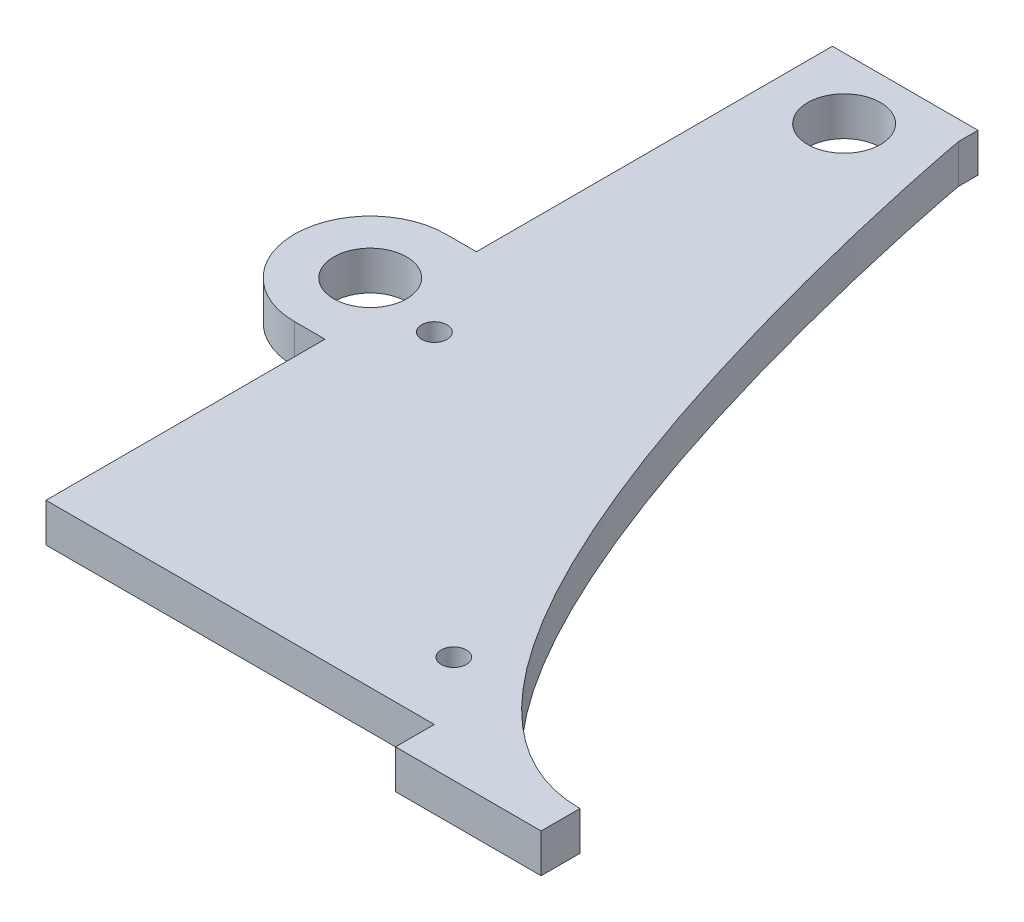
ISO-10303-21;
HEADER;
FILE_DESCRIPTION(('STEP AP214'),'2;1');
FILE_NAME('part.step','',(''),(''),'','','');
FILE_SCHEMA(('AUTOMOTIVE_DESIGN { 1 0 10303 214 1 1 1 1 }'));
ENDSEC;
DATA;
#1=APPLICATION_CONTEXT('core data for automotive mechanical design processes');
#2=APPLICATION_PROTOCOL_DEFINITION('international standard','automotive_design',2000,#1);
#3=PRODUCT_CONTEXT('',#1,'mechanical');
#4=PRODUCT('Part','Part','',(#3));
#5=PRODUCT_RELATED_PRODUCT_CATEGORY('part','',(#4));
#6=PRODUCT_DEFINITION_FORMATION('','',#4);
#7=PRODUCT_DEFINITION_CONTEXT('part definition',#1,'design');
#8=PRODUCT_DEFINITION('design','',#6,#7);
#9=PRODUCT_DEFINITION_SHAPE('','',#8);
#10=(LENGTH_UNIT() NAMED_UNIT(*) SI_UNIT(.MILLI.,.METRE.));
#11=(NAMED_UNIT(*) PLANE_ANGLE_UNIT() SI_UNIT($,.RADIAN.));
#12=(NAMED_UNIT(*) SI_UNIT($,.STERADIAN.) SOLID_ANGLE_UNIT());
#13=UNCERTAINTY_MEASURE_WITH_UNIT(LENGTH_MEASURE(1.E-05),#10,'distance_accuracy_value','');
#14=(GEOMETRIC_REPRESENTATION_CONTEXT(3) GLOBAL_UNCERTAINTY_ASSIGNED_CONTEXT((#13)) GLOBAL_UNIT_ASSIGNED_CONTEXT((#10,
#11,#12)) REPRESENTATION_CONTEXT('',''));
#15=CARTESIAN_POINT('',(0.,0.,0.));
#16=DIRECTION('',(0.,0.,1.));
#17=DIRECTION('',(1.,0.,0.));
#18=AXIS2_PLACEMENT_3D('',#15,#16,#17);
#19=CARTESIAN_POINT('',(-9.525,5.08,48.8950000000001));
#20=DIRECTION('',(1.,0.,0.));
#21=DIRECTION('',(0.,0.,-1.));
#22=AXIS2_PLACEMENT_3D('',#19,#20,#21);
#23=PLANE('',#22);
#24=DIRECTION('',(0.,0.,1.));
#25=VECTOR('',#24,1.);
#26=CARTESIAN_POINT('',(-9.525,5.08,48.8950000000001));
#27=LINE('',#26,#25);
#28=CARTESIAN_POINT('',(-9.52499999999999,5.08,12.4035820000001));
#29=VERTEX_POINT('',#28);
#30=CARTESIAN_POINT('',(-9.525,5.08,48.8950000000001));
#31=VERTEX_POINT('',#30);
#32=EDGE_CURVE('E52',#29,#31,#27,.T.);
#33=ORIENTED_EDGE('',*,*,#32,.F.);
#34=DIRECTION('',(0.,-1.,0.));
#35=VECTOR('',#34,1.);
#36=CARTESIAN_POINT('',(-9.52499999999998,5.08,12.4035820000001));
#37=LINE('',#36,#35);
#38=CARTESIAN_POINT('',(-9.52499999999999,0.,12.4035820000001));
#39=VERTEX_POINT('',#38);
#40=EDGE_CURVE('E165',#29,#39,#37,.T.);
#41=ORIENTED_EDGE('',*,*,#40,.T.);
#42=DIRECTION('',(0.,0.,1.));
#43=VECTOR('',#42,1.);
#44=CARTESIAN_POINT('',(-9.525,0.,48.8950000000001));
#45=LINE('',#44,#43);
#46=CARTESIAN_POINT('',(-9.525,0.,48.8950000000001));
#47=VERTEX_POINT('',#46);
#48=EDGE_CURVE('E312',#39,#47,#45,.T.);
#49=ORIENTED_EDGE('',*,*,#48,.T.);
#50=DIRECTION('',(0.,-1.,0.));
#51=VECTOR('',#50,1.);
#52=CARTESIAN_POINT('',(-9.525,5.08,48.8950000000001));
#53=LINE('',#52,#51);
#54=EDGE_CURVE('E338',#31,#47,#53,.T.);
#55=ORIENTED_EDGE('',*,*,#54,.F.);
#56=EDGE_LOOP('',(#33,#41,#49,#55));
#57=FACE_BOUND('',#56,.T.);
#58=ADVANCED_FACE('F37',(#57),#23,.F.);
#59=CARTESIAN_POINT('',(22.7352910938507,5.08,-1.18732961513015));
#60=DIRECTION('',(0.,-1.,0.));
#61=DIRECTION('',(0.,0.,-1.));
#62=AXIS2_PLACEMENT_3D('',#59,#60,#61);
#63=PLANE('',#62);
#64=CARTESIAN_POINT('',(34.925,5.08,40.0050000000001));
#65=DIRECTION('',(0.,-1.,0.));
#66=DIRECTION('',(0.,0.,-1.));
#67=AXIS2_PLACEMENT_3D('',#64,#65,#66);
#68=CIRCLE('',#67,1.651);
#69=CARTESIAN_POINT('',(34.925,5.08,38.3540000000001));
#70=VERTEX_POINT('',#69);
#71=EDGE_CURVE('E290',#70,#70,#68,.T.);
#72=ORIENTED_EDGE('',*,*,#71,.T.);
#73=EDGE_LOOP('',(#72));
#74=FACE_BOUND('',#73,.T.);
#75=CARTESIAN_POINT('',(-3.17499999999998,5.08,4.44500000000005));
#76=DIRECTION('',(0.,-1.,0.));
#77=DIRECTION('',(0.,0.,-1.));
#78=AXIS2_PLACEMENT_3D('',#75,#76,#77);
#79=CIRCLE('',#78,1.66072838208594);
#80=CARTESIAN_POINT('',(-3.17499999999998,5.08,2.78427161791411));
#81=VERTEX_POINT('',#80);
#82=EDGE_CURVE('E298',#81,#81,#79,.T.);
#83=ORIENTED_EDGE('',*,*,#82,.T.);
#84=EDGE_LOOP('',(#83));
#85=FACE_BOUND('',#84,.T.);
#86=DIRECTION('',(-1.,0.,0.));
#87=VECTOR('',#86,1.);
#88=CARTESIAN_POINT('',(-13.5128,5.08,12.4035820000001));
#89=LINE('',#88,#87);
#90=CARTESIAN_POINT('',(-13.5128,5.08,12.4035820000001));
#91=VERTEX_POINT('',#90);
#92=EDGE_CURVE('E137',#29,#91,#89,.T.);
#93=ORIENTED_EDGE('',*,*,#92,.F.);
#94=ORIENTED_EDGE('',*,*,#32,.T.);
#95=DIRECTION('',(1.,0.,0.));
#96=VECTOR('',#95,1.);
#97=CARTESIAN_POINT('',(60.325,5.08,48.8950000000001));
#98=LINE('',#97,#96);
#99=CARTESIAN_POINT('',(41.275,5.08,48.8950000000001));
#100=VERTEX_POINT('',#99);
#101=EDGE_CURVE('E205',#31,#100,#98,.T.);
#102=ORIENTED_EDGE('',*,*,#101,.T.);
#103=DIRECTION('',(0.,0.,1.));
#104=VECTOR('',#103,1.);
#105=CARTESIAN_POINT('',(41.275,5.08,48.8950000000001));
#106=LINE('',#105,#104);
#107=CARTESIAN_POINT('',(41.275,5.08,53.9750000000001));
#108=VERTEX_POINT('',#107);
#109=EDGE_CURVE('E172',#100,#108,#106,.T.);
#110=ORIENTED_EDGE('',*,*,#109,.T.);
#111=DIRECTION('',(1.,0.,0.));
#112=VECTOR('',#111,1.);
#113=CARTESIAN_POINT('',(60.325,5.08,53.9750000000001));
#114=LINE('',#113,#112);
#115=CARTESIAN_POINT('',(60.325,5.08,53.9750000000001));
#116=VERTEX_POINT('',#115);
#117=EDGE_CURVE('E168',#108,#116,#114,.T.);
#118=ORIENTED_EDGE('',*,*,#117,.T.);
#119=DIRECTION('',(0.,0.,-1.));
#120=VECTOR('',#119,1.);
#121=CARTESIAN_POINT('',(60.325,5.08,48.8950000000001));
#122=LINE('',#121,#120);
#123=CARTESIAN_POINT('',(60.325,5.08,48.8950000000001));
#124=VERTEX_POINT('',#123);
#125=EDGE_CURVE('E164',#116,#124,#122,.T.);
#126=ORIENTED_EDGE('',*,*,#125,.T.);
#127=CARTESIAN_POINT('',(60.325,5.08,48.895));
#128=CARTESIAN_POINT('',(27.8191095836019,5.08,48.895));
#129=CARTESIAN_POINT('',(9.525,5.08,-51.214545640347));
#130=CARTESIAN_POINT('',(9.525,5.08,-51.435));
#131=B_SPLINE_CURVE_WITH_KNOTS('',3,(#127,#128,#129,#130),.UNSPECIFIED.,.F.,.F.,(4,4),(0.,1.),.UNSPECIFIED.);
#132=CARTESIAN_POINT('',(9.525,5.08,-51.435));
#133=VERTEX_POINT('',#132);
#134=EDGE_CURVE('E208',#124,#133,#131,.T.);
#135=ORIENTED_EDGE('',*,*,#134,.T.);
#136=DIRECTION('',(0.,0.,-1.));
#137=VECTOR('',#136,1.);
#138=CARTESIAN_POINT('',(9.525,5.08,-51.435));
#139=LINE('',#138,#137);
#140=CARTESIAN_POINT('',(9.52499999999999,5.08,-53.9749999999999));
#141=VERTEX_POINT('',#140);
#142=EDGE_CURVE('E198',#133,#141,#139,.T.);
#143=ORIENTED_EDGE('',*,*,#142,.T.);
#144=DIRECTION('',(-1.,0.,0.));
#145=VECTOR('',#144,1.);
#146=CARTESIAN_POINT('',(-9.52499999999998,5.08,-53.9749999999999));
#147=LINE('',#146,#145);
#148=CARTESIAN_POINT('',(-9.52499999999998,5.08,-53.9749999999999));
#149=VERTEX_POINT('',#148);
#150=EDGE_CURVE('E201',#141,#149,#147,.T.);
#151=ORIENTED_EDGE('',*,*,#150,.T.);
#152=CARTESIAN_POINT('',(-9.52499999999999,5.08,-7.40841799999996));
#153=VERTEX_POINT('',#152);
#154=EDGE_CURVE('E146',#149,#153,#27,.T.);
#155=ORIENTED_EDGE('',*,*,#154,.T.);
#156=DIRECTION('',(1.,0.,0.));
#157=VECTOR('',#156,1.);
#158=CARTESIAN_POINT('',(-13.5128,5.08,-7.40841799999996));
#159=LINE('',#158,#157);
#160=CARTESIAN_POINT('',(-13.5128,5.08,-7.40841799999996));
#161=VERTEX_POINT('',#160);
#162=EDGE_CURVE('E130',#161,#153,#159,.T.);
#163=ORIENTED_EDGE('',*,*,#162,.F.);
#164=CARTESIAN_POINT('',(-13.5128,5.08,2.49758200000005));
#165=DIRECTION('',(0.,-1.,0.));
#166=DIRECTION('',(0.,0.,-1.));
#167=AXIS2_PLACEMENT_3D('',#164,#165,#166);
#168=CIRCLE('',#167,9.90600000000001);
#169=EDGE_CURVE('E144',#91,#161,#168,.T.);
#170=ORIENTED_EDGE('',*,*,#169,.F.);
#171=EDGE_LOOP('',(#93,#94,#102,#110,#118,#126,#135,#143,#151,#155,#163,#170));
#172=FACE_BOUND('',#171,.T.);
#173=CARTESIAN_POINT('',(-13.5128,5.08,2.49758200000005));
#174=DIRECTION('',(0.,-1.,0.));
#175=DIRECTION('',(0.,0.,-1.));
#176=AXIS2_PLACEMENT_3D('',#173,#174,#175);
#177=CIRCLE('',#176,4.7625);
#178=CARTESIAN_POINT('',(-13.5128,5.08,-2.26491799999995));
#179=VERTEX_POINT('',#178);
#180=EDGE_CURVE('E161',#179,#179,#177,.T.);
#181=ORIENTED_EDGE('',*,*,#180,.T.);
#182=EDGE_LOOP('',(#181));
#183=FACE_BOUND('',#182,.T.);
#184=CARTESIAN_POINT('',(0.,5.08,-45.9866999999999));
#185=DIRECTION('',(0.,1.,0.));
#186=DIRECTION('',(0.,0.,1.));
#187=AXIS2_PLACEMENT_3D('',#184,#185,#186);
#188=CIRCLE('',#187,4.7625);
#189=CARTESIAN_POINT('',(0.,5.08,-41.2241999999999));
#190=VERTEX_POINT('',#189);
#191=EDGE_CURVE('E192',#190,#190,#188,.T.);
#192=ORIENTED_EDGE('',*,*,#191,.F.);
#193=EDGE_LOOP('',(#192));
#194=FACE_BOUND('',#193,.T.);
#195=ADVANCED_FACE('F142',(#74,#85,#172,#183,#194),#63,.F.);
#196=CARTESIAN_POINT('',(22.7352910938507,0.,-1.18732961513015));
#197=DIRECTION('',(0.,-1.,0.));
#198=DIRECTION('',(0.,0.,-1.));
#199=AXIS2_PLACEMENT_3D('',#196,#197,#198);
#200=PLANE('',#199);
#201=CARTESIAN_POINT('',(34.925,0.,40.0050000000001));
#202=DIRECTION('',(0.,-1.,0.));
#203=DIRECTION('',(0.,0.,-1.));
#204=AXIS2_PLACEMENT_3D('',#201,#202,#203);
#205=CIRCLE('',#204,1.651);
#206=CARTESIAN_POINT('',(34.925,0.,38.3540000000001));
#207=VERTEX_POINT('',#206);
#208=EDGE_CURVE('E293',#207,#207,#205,.T.);
#209=ORIENTED_EDGE('',*,*,#208,.F.);
#210=EDGE_LOOP('',(#209));
#211=FACE_BOUND('',#210,.T.);
#212=CARTESIAN_POINT('',(-3.17499999999998,0.,4.44500000000005));
#213=DIRECTION('',(0.,-1.,0.));
#214=DIRECTION('',(0.,0.,-1.));
#215=AXIS2_PLACEMENT_3D('',#212,#213,#214);
#216=CIRCLE('',#215,1.66072838208594);
#217=CARTESIAN_POINT('',(-3.17499999999998,0.,2.78427161791411));
#218=VERTEX_POINT('',#217);
#219=EDGE_CURVE('E294',#218,#218,#216,.T.);
#220=ORIENTED_EDGE('',*,*,#219,.F.);
#221=EDGE_LOOP('',(#220));
#222=FACE_BOUND('',#221,.T.);
#223=CARTESIAN_POINT('',(-13.5128,0.,2.49758200000005));
#224=DIRECTION('',(0.,-1.,0.));
#225=DIRECTION('',(0.,0.,-1.));
#226=AXIS2_PLACEMENT_3D('',#223,#224,#225);
#227=CIRCLE('',#226,4.7625);
#228=CARTESIAN_POINT('',(-13.5128,0.,-2.26491799999995));
#229=VERTEX_POINT('',#228);
#230=EDGE_CURVE('E155',#229,#229,#227,.T.);
#231=ORIENTED_EDGE('',*,*,#230,.F.);
#232=EDGE_LOOP('',(#231));
#233=FACE_BOUND('',#232,.T.);
#234=ORIENTED_EDGE('',*,*,#48,.F.);
#235=DIRECTION('',(-1.,0.,0.));
#236=VECTOR('',#235,1.);
#237=CARTESIAN_POINT('',(-13.5128,0.,12.4035820000001));
#238=LINE('',#237,#236);
#239=CARTESIAN_POINT('',(-13.5128,0.,12.4035820000001));
#240=VERTEX_POINT('',#239);
#241=EDGE_CURVE('E150',#39,#240,#238,.T.);
#242=ORIENTED_EDGE('',*,*,#241,.T.);
#243=CARTESIAN_POINT('',(-13.5128,0.,2.49758200000005));
#244=DIRECTION('',(0.,-1.,0.));
#245=DIRECTION('',(0.,0.,-1.));
#246=AXIS2_PLACEMENT_3D('',#243,#244,#245);
#247=CIRCLE('',#246,9.90600000000001);
#248=CARTESIAN_POINT('',(-13.5128,0.,-7.40841799999996));
#249=VERTEX_POINT('',#248);
#250=EDGE_CURVE('E159',#240,#249,#247,.T.);
#251=ORIENTED_EDGE('',*,*,#250,.T.);
#252=DIRECTION('',(1.,0.,0.));
#253=VECTOR('',#252,1.);
#254=CARTESIAN_POINT('',(-13.5128,0.,-7.40841799999996));
#255=LINE('',#254,#253);
#256=CARTESIAN_POINT('',(-9.52499999999999,0.,-7.40841799999996));
#257=VERTEX_POINT('',#256);
#258=EDGE_CURVE('E132',#249,#257,#255,.T.);
#259=ORIENTED_EDGE('',*,*,#258,.T.);
#260=CARTESIAN_POINT('',(-9.52499999999998,0.,-53.9749999999999));
#261=VERTEX_POINT('',#260);
#262=EDGE_CURVE('E319',#261,#257,#45,.T.);
#263=ORIENTED_EDGE('',*,*,#262,.F.);
#264=DIRECTION('',(-1.,0.,0.));
#265=VECTOR('',#264,1.);
#266=CARTESIAN_POINT('',(-9.52499999999998,0.,-53.9749999999999));
#267=LINE('',#266,#265);
#268=CARTESIAN_POINT('',(9.52499999999999,0.,-53.9749999999999));
#269=VERTEX_POINT('',#268);
#270=EDGE_CURVE('E320',#269,#261,#267,.T.);
#271=ORIENTED_EDGE('',*,*,#270,.F.);
#272=DIRECTION('',(0.,0.,-1.));
#273=VECTOR('',#272,1.);
#274=CARTESIAN_POINT('',(9.525,0.,-51.435));
#275=LINE('',#274,#273);
#276=CARTESIAN_POINT('',(9.525,0.,-51.435));
#277=VERTEX_POINT('',#276);
#278=EDGE_CURVE('E195',#277,#269,#275,.T.);
#279=ORIENTED_EDGE('',*,*,#278,.F.);
#280=CARTESIAN_POINT('',(60.325,0.,48.895));
#281=CARTESIAN_POINT('',(27.8191095836019,0.,48.895));
#282=CARTESIAN_POINT('',(9.525,0.,-51.214545640347));
#283=CARTESIAN_POINT('',(9.525,0.,-51.435));
#284=B_SPLINE_CURVE_WITH_KNOTS('',3,(#280,#281,#282,#283),.UNSPECIFIED.,.F.,.F.,(4,4),(0.,1.),.UNSPECIFIED.);
#285=CARTESIAN_POINT('',(60.325,0.,48.8950000000001));
#286=VERTEX_POINT('',#285);
#287=EDGE_CURVE('E202',#286,#277,#284,.T.);
#288=ORIENTED_EDGE('',*,*,#287,.F.);
#289=DIRECTION('',(0.,0.,-1.));
#290=VECTOR('',#289,1.);
#291=CARTESIAN_POINT('',(60.325,0.,48.8950000000001));
#292=LINE('',#291,#290);
#293=CARTESIAN_POINT('',(60.325,0.,53.9750000000001));
#294=VERTEX_POINT('',#293);
#295=EDGE_CURVE('E177',#294,#286,#292,.T.);
#296=ORIENTED_EDGE('',*,*,#295,.F.);
#297=DIRECTION('',(1.,0.,0.));
#298=VECTOR('',#297,1.);
#299=CARTESIAN_POINT('',(60.325,0.,53.9750000000001));
#300=LINE('',#299,#298);
#301=CARTESIAN_POINT('',(41.275,0.,53.9750000000001));
#302=VERTEX_POINT('',#301);
#303=EDGE_CURVE('E181',#302,#294,#300,.T.);
#304=ORIENTED_EDGE('',*,*,#303,.F.);
#305=DIRECTION('',(0.,0.,1.));
#306=VECTOR('',#305,1.);
#307=CARTESIAN_POINT('',(41.275,0.,48.8950000000001));
#308=LINE('',#307,#306);
#309=CARTESIAN_POINT('',(41.275,0.,48.8950000000001));
#310=VERTEX_POINT('',#309);
#311=EDGE_CURVE('E185',#310,#302,#308,.T.);
#312=ORIENTED_EDGE('',*,*,#311,.F.);
#313=DIRECTION('',(1.,0.,0.));
#314=VECTOR('',#313,1.);
#315=CARTESIAN_POINT('',(60.325,0.,48.8950000000001));
#316=LINE('',#315,#314);
#317=EDGE_CURVE('E317',#47,#310,#316,.T.);
#318=ORIENTED_EDGE('',*,*,#317,.F.);
#319=EDGE_LOOP('',(#234,#242,#251,#259,#263,#271,#279,#288,#296,#304,#312,#318));
#320=FACE_BOUND('',#319,.T.);
#321=CARTESIAN_POINT('',(0.,0.,-45.9866999999999));
#322=DIRECTION('',(0.,1.,0.));
#323=DIRECTION('',(0.,0.,1.));
#324=AXIS2_PLACEMENT_3D('',#321,#322,#323);
#325=CIRCLE('',#324,4.7625);
#326=CARTESIAN_POINT('',(0.,0.,-41.2241999999999));
#327=VERTEX_POINT('',#326);
#328=EDGE_CURVE('E179',#327,#327,#325,.T.);
#329=ORIENTED_EDGE('',*,*,#328,.T.);
#330=EDGE_LOOP('',(#329));
#331=FACE_BOUND('',#330,.T.);
#332=ADVANCED_FACE('F226',(#211,#222,#233,#320,#331),#200,.T.);
#333=CARTESIAN_POINT('',(9.525,5.08,-51.435));
#334=DIRECTION('',(-1.,0.,0.));
#335=DIRECTION('',(0.,0.,1.));
#336=AXIS2_PLACEMENT_3D('',#333,#334,#335);
#337=PLANE('',#336);
#338=ORIENTED_EDGE('',*,*,#278,.T.);
#339=DIRECTION('',(0.,-1.,0.));
#340=VECTOR('',#339,1.);
#341=CARTESIAN_POINT('',(9.52499999999999,5.08,-53.9749999999999));
#342=LINE('',#341,#340);
#343=EDGE_CURVE('E11',#141,#269,#342,.T.);
#344=ORIENTED_EDGE('',*,*,#343,.F.);
#345=ORIENTED_EDGE('',*,*,#142,.F.);
#346=DIRECTION('',(0.,-1.,0.));
#347=VECTOR('',#346,1.);
#348=CARTESIAN_POINT('',(9.525,5.08,-51.435));
#349=LINE('',#348,#347);
#350=EDGE_CURVE('E213',#133,#277,#349,.T.);
#351=ORIENTED_EDGE('',*,*,#350,.T.);
#352=EDGE_LOOP('',(#338,#344,#345,#351));
#353=FACE_BOUND('',#352,.T.);
#354=ADVANCED_FACE('F39',(#353),#337,.F.);
#355=CARTESIAN_POINT('',(-9.52499999999998,5.08,-53.9749999999999));
#356=DIRECTION('',(0.,0.,1.));
#357=DIRECTION('',(1.,0.,0.));
#358=AXIS2_PLACEMENT_3D('',#355,#356,#357);
#359=PLANE('',#358);
#360=ORIENTED_EDGE('',*,*,#270,.T.);
#361=DIRECTION('',(0.,-1.,0.));
#362=VECTOR('',#361,1.);
#363=CARTESIAN_POINT('',(-9.52499999999998,5.08,-53.9749999999999));
#364=LINE('',#363,#362);
#365=EDGE_CURVE('E45',#149,#261,#364,.T.);
#366=ORIENTED_EDGE('',*,*,#365,.F.);
#367=ORIENTED_EDGE('',*,*,#150,.F.);
#368=ORIENTED_EDGE('',*,*,#343,.T.);
#369=EDGE_LOOP('',(#360,#366,#367,#368));
#370=FACE_BOUND('',#369,.T.);
#371=ADVANCED_FACE('F233',(#370),#359,.F.);
#372=ORIENTED_EDGE('',*,*,#262,.T.);
#373=DIRECTION('',(0.,-1.,0.));
#374=VECTOR('',#373,1.);
#375=CARTESIAN_POINT('',(-9.52499999999998,5.08,-7.40841799999996));
#376=LINE('',#375,#374);
#377=EDGE_CURVE('E60',#153,#257,#376,.T.);
#378=ORIENTED_EDGE('',*,*,#377,.F.);
#379=ORIENTED_EDGE('',*,*,#154,.F.);
#380=ORIENTED_EDGE('',*,*,#365,.T.);
#381=EDGE_LOOP('',(#372,#378,#379,#380));
#382=FACE_BOUND('',#381,.T.);
#383=ADVANCED_FACE('F230',(#382),#23,.F.);
#384=CARTESIAN_POINT('',(60.325,5.08,48.8950000000001));
#385=DIRECTION('',(0.,0.,-1.));
#386=DIRECTION('',(-1.,0.,0.));
#387=AXIS2_PLACEMENT_3D('',#384,#385,#386);
#388=PLANE('',#387);
#389=ORIENTED_EDGE('',*,*,#317,.T.);
#390=DIRECTION('',(0.,1.,0.));
#391=VECTOR('',#390,1.);
#392=CARTESIAN_POINT('',(41.275,-19.7157018642502,48.8950000000001));
#393=LINE('',#392,#391);
#394=EDGE_CURVE('E171',#310,#100,#393,.T.);
#395=ORIENTED_EDGE('',*,*,#394,.T.);
#396=ORIENTED_EDGE('',*,*,#101,.F.);
#397=ORIENTED_EDGE('',*,*,#54,.T.);
#398=EDGE_LOOP('',(#389,#395,#396,#397));
#399=FACE_BOUND('',#398,.T.);
#400=ADVANCED_FACE('F224',(#399),#388,.F.);
#401=DIRECTION('',(0.,-1.,0.));
#402=VECTOR('',#401,1.);
#403=SURFACE_OF_LINEAR_EXTRUSION('',#131,#402);
#404=ORIENTED_EDGE('',*,*,#287,.T.);
#405=ORIENTED_EDGE('',*,*,#350,.F.);
#406=ORIENTED_EDGE('',*,*,#134,.F.);
#407=DIRECTION('',(0.,-1.,0.));
#408=VECTOR('',#407,1.);
#409=CARTESIAN_POINT('',(60.325,5.08,48.8950000000001));
#410=LINE('',#409,#408);
#411=EDGE_CURVE('E335',#124,#286,#410,.T.);
#412=ORIENTED_EDGE('',*,*,#411,.T.);
#413=EDGE_LOOP('',(#404,#405,#406,#412));
#414=FACE_BOUND('',#413,.T.);
#415=ADVANCED_FACE('F219',(#414),#403,.F.);
#416=CARTESIAN_POINT('',(0.,5.08,-45.9866999999999));
#417=DIRECTION('',(0.,-1.,0.));
#418=DIRECTION('',(0.,0.,-1.));
#419=AXIS2_PLACEMENT_3D('',#416,#417,#418);
#420=CYLINDRICAL_SURFACE('',#419,4.7625);
#421=ORIENTED_EDGE('',*,*,#191,.T.);
#422=EDGE_LOOP('',(#421));
#423=FACE_BOUND('',#422,.T.);
#424=ORIENTED_EDGE('',*,*,#328,.F.);
#425=EDGE_LOOP('',(#424));
#426=FACE_BOUND('',#425,.T.);
#427=ADVANCED_FACE('F223',(#423,#426),#420,.F.);
#428=CARTESIAN_POINT('',(41.275,-19.7157018642502,48.8950000000001));
#429=DIRECTION('',(-1.,0.,0.));
#430=DIRECTION('',(0.,0.,1.));
#431=AXIS2_PLACEMENT_3D('',#428,#429,#430);
#432=PLANE('',#431);
#433=ORIENTED_EDGE('',*,*,#394,.F.);
#434=ORIENTED_EDGE('',*,*,#311,.T.);
#435=DIRECTION('',(0.,1.,0.));
#436=VECTOR('',#435,1.);
#437=CARTESIAN_POINT('',(41.275,-19.7157018642502,53.9750000000001));
#438=LINE('',#437,#436);
#439=EDGE_CURVE('E184',#302,#108,#438,.T.);
#440=ORIENTED_EDGE('',*,*,#439,.T.);
#441=ORIENTED_EDGE('',*,*,#109,.F.);
#442=EDGE_LOOP('',(#433,#434,#440,#441));
#443=FACE_BOUND('',#442,.T.);
#444=ADVANCED_FACE('F254',(#443),#432,.T.);
#445=CARTESIAN_POINT('',(60.325,-19.7157018642502,53.9750000000001));
#446=DIRECTION('',(0.,0.,1.));
#447=DIRECTION('',(1.,0.,0.));
#448=AXIS2_PLACEMENT_3D('',#445,#446,#447);
#449=PLANE('',#448);
#450=ORIENTED_EDGE('',*,*,#439,.F.);
#451=ORIENTED_EDGE('',*,*,#303,.T.);
#452=DIRECTION('',(0.,1.,0.));
#453=VECTOR('',#452,1.);
#454=CARTESIAN_POINT('',(60.325,-19.7157018642502,53.9750000000001));
#455=LINE('',#454,#453);
#456=EDGE_CURVE('E180',#294,#116,#455,.T.);
#457=ORIENTED_EDGE('',*,*,#456,.T.);
#458=ORIENTED_EDGE('',*,*,#117,.F.);
#459=EDGE_LOOP('',(#450,#451,#457,#458));
#460=FACE_BOUND('',#459,.T.);
#461=ADVANCED_FACE('F258',(#460),#449,.T.);
#462=CARTESIAN_POINT('',(60.325,-19.7157018642502,48.8950000000001));
#463=DIRECTION('',(1.,0.,0.));
#464=DIRECTION('',(0.,0.,-1.));
#465=AXIS2_PLACEMENT_3D('',#462,#463,#464);
#466=PLANE('',#465);
#467=ORIENTED_EDGE('',*,*,#456,.F.);
#468=ORIENTED_EDGE('',*,*,#295,.T.);
#469=ORIENTED_EDGE('',*,*,#411,.F.);
#470=ORIENTED_EDGE('',*,*,#125,.F.);
#471=EDGE_LOOP('',(#467,#468,#469,#470));
#472=FACE_BOUND('',#471,.T.);
#473=ADVANCED_FACE('F262',(#472),#466,.T.);
#474=CARTESIAN_POINT('',(-13.5128,5.08,2.49758200000005));
#475=DIRECTION('',(0.,-1.,0.));
#476=DIRECTION('',(0.,0.,-1.));
#477=AXIS2_PLACEMENT_3D('',#474,#475,#476);
#478=CYLINDRICAL_SURFACE('',#477,4.7625);
#479=ORIENTED_EDGE('',*,*,#180,.F.);
#480=EDGE_LOOP('',(#479));
#481=FACE_BOUND('',#480,.T.);
#482=ORIENTED_EDGE('',*,*,#230,.T.);
#483=EDGE_LOOP('',(#482));
#484=FACE_BOUND('',#483,.T.);
#485=ADVANCED_FACE('F266',(#481,#484),#478,.F.);
#486=CARTESIAN_POINT('',(-13.5128,5.08,2.49758200000005));
#487=DIRECTION('',(0.,-1.,0.));
#488=DIRECTION('',(0.,0.,-1.));
#489=AXIS2_PLACEMENT_3D('',#486,#487,#488);
#490=CYLINDRICAL_SURFACE('',#489,9.90600000000001);
#491=ORIENTED_EDGE('',*,*,#250,.F.);
#492=DIRECTION('',(0.,-1.,0.));
#493=VECTOR('',#492,1.);
#494=CARTESIAN_POINT('',(-13.5128,5.08,12.4035820000001));
#495=LINE('',#494,#493);
#496=EDGE_CURVE('E149',#91,#240,#495,.T.);
#497=ORIENTED_EDGE('',*,*,#496,.F.);
#498=ORIENTED_EDGE('',*,*,#169,.T.);
#499=DIRECTION('',(0.,-1.,0.));
#500=VECTOR('',#499,1.);
#501=CARTESIAN_POINT('',(-13.5128,5.08,-7.40841799999996));
#502=LINE('',#501,#500);
#503=EDGE_CURVE('E127',#161,#249,#502,.T.);
#504=ORIENTED_EDGE('',*,*,#503,.T.);
#505=EDGE_LOOP('',(#491,#497,#498,#504));
#506=FACE_BOUND('',#505,.T.);
#507=ADVANCED_FACE('F148',(#506),#490,.T.);
#508=CARTESIAN_POINT('',(-13.5128,5.08,12.4035820000001));
#509=DIRECTION('',(0.,0.,1.));
#510=DIRECTION('',(1.,0.,0.));
#511=AXIS2_PLACEMENT_3D('',#508,#509,#510);
#512=PLANE('',#511);
#513=ORIENTED_EDGE('',*,*,#241,.F.);
#514=ORIENTED_EDGE('',*,*,#40,.F.);
#515=ORIENTED_EDGE('',*,*,#92,.T.);
#516=ORIENTED_EDGE('',*,*,#496,.T.);
#517=EDGE_LOOP('',(#513,#514,#515,#516));
#518=FACE_BOUND('',#517,.T.);
#519=ADVANCED_FACE('F270',(#518),#512,.T.);
#520=CARTESIAN_POINT('',(-13.5128,5.08,-7.40841799999996));
#521=DIRECTION('',(0.,0.,-1.));
#522=DIRECTION('',(-1.,0.,0.));
#523=AXIS2_PLACEMENT_3D('',#520,#521,#522);
#524=PLANE('',#523);
#525=ORIENTED_EDGE('',*,*,#258,.F.);
#526=ORIENTED_EDGE('',*,*,#503,.F.);
#527=ORIENTED_EDGE('',*,*,#162,.T.);
#528=ORIENTED_EDGE('',*,*,#377,.T.);
#529=EDGE_LOOP('',(#525,#526,#527,#528));
#530=FACE_BOUND('',#529,.T.);
#531=ADVANCED_FACE('F129',(#530),#524,.T.);
#532=CARTESIAN_POINT('',(-3.17499999999998,5.08,4.44500000000005));
#533=DIRECTION('',(0.,-1.,0.));
#534=DIRECTION('',(0.,0.,-1.));
#535=AXIS2_PLACEMENT_3D('',#532,#533,#534);
#536=CYLINDRICAL_SURFACE('',#535,1.66072838208594);
#537=ORIENTED_EDGE('',*,*,#82,.F.);
#538=EDGE_LOOP('',(#537));
#539=FACE_BOUND('',#538,.T.);
#540=ORIENTED_EDGE('',*,*,#219,.T.);
#541=EDGE_LOOP('',(#540));
#542=FACE_BOUND('',#541,.T.);
#543=ADVANCED_FACE('F273',(#539,#542),#536,.F.);
#544=CARTESIAN_POINT('',(34.925,5.08,40.0050000000001));
#545=DIRECTION('',(0.,-1.,0.));
#546=DIRECTION('',(0.,0.,-1.));
#547=AXIS2_PLACEMENT_3D('',#544,#545,#546);
#548=CYLINDRICAL_SURFACE('',#547,1.651);
#549=ORIENTED_EDGE('',*,*,#71,.F.);
#550=EDGE_LOOP('',(#549));
#551=FACE_BOUND('',#550,.T.);
#552=ORIENTED_EDGE('',*,*,#208,.T.);
#553=EDGE_LOOP('',(#552));
#554=FACE_BOUND('',#553,.T.);
#555=ADVANCED_FACE('F282',(#551,#554),#548,.F.);
#556=CLOSED_SHELL('',(#58,#195,#332,#354,#371,#383,#400,#415,#427,#444,#461,#473,#485,#507,#519,
#531,#543,#555));
#557=MANIFOLD_SOLID_BREP('B2',#556);
#558=ADVANCED_BREP_SHAPE_REPRESENTATION('',(#18,#557),#14);
#559=SHAPE_DEFINITION_REPRESENTATION(#9,#558);
ENDSEC;
END-ISO-10303-21;
